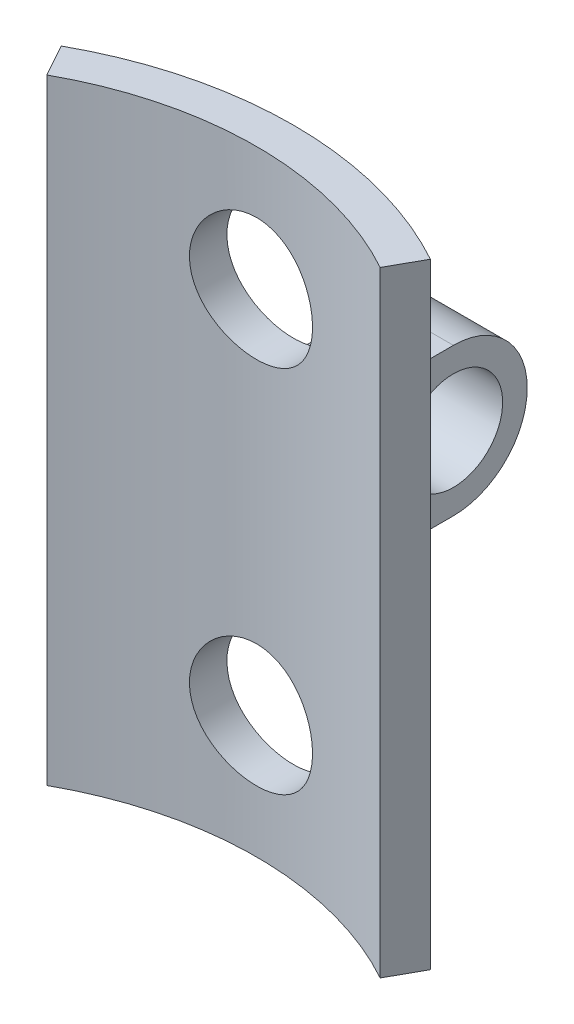
ISO-10303-21;
HEADER;
FILE_DESCRIPTION(('STEP AP214'),'2;1');
FILE_NAME('part.step','',(''),(''),'','','');
FILE_SCHEMA(('AUTOMOTIVE_DESIGN { 1 0 10303 214 1 1 1 1 }'));
ENDSEC;
DATA;
#1=APPLICATION_CONTEXT('core data for automotive mechanical design processes');
#2=APPLICATION_PROTOCOL_DEFINITION('international standard','automotive_design',2000,#1);
#3=PRODUCT_CONTEXT('',#1,'mechanical');
#4=PRODUCT('Part','Part','',(#3));
#5=PRODUCT_RELATED_PRODUCT_CATEGORY('part','',(#4));
#6=PRODUCT_DEFINITION_FORMATION('','',#4);
#7=PRODUCT_DEFINITION_CONTEXT('part definition',#1,'design');
#8=PRODUCT_DEFINITION('design','',#6,#7);
#9=PRODUCT_DEFINITION_SHAPE('','',#8);
#10=(LENGTH_UNIT() NAMED_UNIT(*) SI_UNIT(.MILLI.,.METRE.));
#11=(NAMED_UNIT(*) PLANE_ANGLE_UNIT() SI_UNIT($,.RADIAN.));
#12=(NAMED_UNIT(*) SI_UNIT($,.STERADIAN.) SOLID_ANGLE_UNIT());
#13=UNCERTAINTY_MEASURE_WITH_UNIT(LENGTH_MEASURE(1.E-05),#10,'distance_accuracy_value','');
#14=(GEOMETRIC_REPRESENTATION_CONTEXT(3) GLOBAL_UNCERTAINTY_ASSIGNED_CONTEXT((#13)) GLOBAL_UNIT_ASSIGNED_CONTEXT((#10,
#11,#12)) REPRESENTATION_CONTEXT('',''));
#15=CARTESIAN_POINT('',(0.,0.,0.));
#16=DIRECTION('',(0.,0.,1.));
#17=DIRECTION('',(1.,0.,0.));
#18=AXIS2_PLACEMENT_3D('',#15,#16,#17);
#19=CARTESIAN_POINT('',(0.,25.,0.));
#20=DIRECTION('',(0.,-1.,0.));
#21=DIRECTION('',(0.,0.,-1.));
#22=AXIS2_PLACEMENT_3D('',#19,#20,#21);
#23=CYLINDRICAL_SURFACE('',#22,15.5);
#24=DIRECTION('',(0.,1.,0.));
#25=VECTOR('',#24,1.);
#26=CARTESIAN_POINT('',(-7.49999999999999,0.,-13.5646599662505));
#27=LINE('',#26,#25);
#28=CARTESIAN_POINT('',(-7.49999999999999,0.,-13.5646599662505));
#29=VERTEX_POINT('',#28);
#30=CARTESIAN_POINT('',(-7.49999999999999,25.,-13.5646599662505));
#31=VERTEX_POINT('',#30);
#32=EDGE_CURVE('E217',#29,#31,#27,.T.);
#33=ORIENTED_EDGE('',*,*,#32,.T.);
#34=CARTESIAN_POINT('',(0.,25.,0.));
#35=DIRECTION('',(0.,1.,0.));
#36=DIRECTION('',(0.,0.,1.));
#37=AXIS2_PLACEMENT_3D('',#34,#35,#36);
#38=CIRCLE('',#37,15.5);
#39=CARTESIAN_POINT('',(7.5,25.,-13.5646599662505));
#40=VERTEX_POINT('',#39);
#41=EDGE_CURVE('E418',#40,#31,#38,.T.);
#42=ORIENTED_EDGE('',*,*,#41,.F.);
#43=DIRECTION('',(0.,1.,0.));
#44=VECTOR('',#43,1.);
#45=CARTESIAN_POINT('',(7.5,0.,-13.5646599662505));
#46=LINE('',#45,#44);
#47=CARTESIAN_POINT('',(7.5,0.,-13.5646599662505));
#48=VERTEX_POINT('',#47);
#49=EDGE_CURVE('E408',#48,#40,#46,.T.);
#50=ORIENTED_EDGE('',*,*,#49,.F.);
#51=CARTESIAN_POINT('',(0.,0.,0.));
#52=DIRECTION('',(0.,1.,0.));
#53=DIRECTION('',(0.,0.,1.));
#54=AXIS2_PLACEMENT_3D('',#51,#52,#53);
#55=CIRCLE('',#54,15.5);
#56=EDGE_CURVE('E417',#48,#29,#55,.T.);
#57=ORIENTED_EDGE('',*,*,#56,.T.);
#58=EDGE_LOOP('',(#33,#42,#50,#57));
#59=FACE_BOUND('',#58,.T.);
#60=CARTESIAN_POINT('',(0.,7.5,-15.5));
#61=CARTESIAN_POINT('',(-0.13945596550187,7.49999435258692,-15.4999976564305));
#62=CARTESIAN_POINT('',(-0.278989648774299,7.48829180990405,-15.498098294507));
#63=CARTESIAN_POINT('',(-0.554147970372303,7.44180775903168,-15.4907042283466));
#64=CARTESIAN_POINT('',(-0.689768818906215,7.40700461119143,-15.4852061530574));
#65=CARTESIAN_POINT('',(-0.953080306691496,7.31539380184043,-15.4712317355813));
#66=CARTESIAN_POINT('',(-1.08077717512847,7.25860368561123,-15.4627577686126));
#67=CARTESIAN_POINT('',(-1.32481208801264,7.12467594226584,-15.4437648486657));
#68=CARTESIAN_POINT('',(-1.44115152161203,7.04754080787544,-15.4332461462555));
#69=CARTESIAN_POINT('',(-1.66023096976482,6.87437554390219,-15.4112254446898));
#70=CARTESIAN_POINT('',(-1.76285422580718,6.77819860017883,-15.3997162251001));
#71=CARTESIAN_POINT('',(-1.95058004634512,6.56999582466922,-15.3770673288068));
#72=CARTESIAN_POINT('',(-2.03568153854731,6.45796902361398,-15.3659276747548));
#73=CARTESIAN_POINT('',(-2.18641161674849,6.22045028795695,-15.3452092274256));
#74=CARTESIAN_POINT('',(-2.25192556665198,6.09488472012622,-15.335639765281));
#75=CARTESIAN_POINT('',(-2.36088794560196,5.83435126895828,-15.3192448622395));
#76=CARTESIAN_POINT('',(-2.40433776829785,5.69938398008002,-15.3124192480371));
#77=CARTESIAN_POINT('',(-2.46757236787698,5.42511284801972,-15.3023564578224));
#78=CARTESIAN_POINT('',(-2.48755817575628,5.28585649220208,-15.2990888162356));
#79=CARTESIAN_POINT('',(-2.50392054645118,5.0059313863757,-15.2964196812258));
#80=CARTESIAN_POINT('',(-2.50029867442453,4.86526273061794,-15.2970179314992));
#81=CARTESIAN_POINT('',(-2.46971242247048,4.58793614510759,-15.3019851549817));
#82=CARTESIAN_POINT('',(-2.44297322501096,4.45125263400227,-15.3063177512409));
#83=CARTESIAN_POINT('',(-2.36726444218478,4.18433775550028,-15.3182085898593));
#84=CARTESIAN_POINT('',(-2.31829413868152,4.05410659668619,-15.3257669364201));
#85=CARTESIAN_POINT('',(-2.199282965199,3.80311541366621,-15.3432972328273));
#86=CARTESIAN_POINT('',(-2.1291479638593,3.68240080437212,-15.3532799255619));
#87=CARTESIAN_POINT('',(-1.96986516988218,3.45436827062704,-15.3745265587829));
#88=CARTESIAN_POINT('',(-1.88071593811721,3.34705136118124,-15.3857905962201));
#89=CARTESIAN_POINT('',(-1.6847053407449,3.14755655512885,-15.4084908838004));
#90=CARTESIAN_POINT('',(-1.57765063633714,3.05556856962561,-15.4199276166392));
#91=CARTESIAN_POINT('',(-1.34952355203601,2.89083410566069,-15.441563780858));
#92=CARTESIAN_POINT('',(-1.22845109214106,2.81808773702178,-15.4517632051757));
#93=CARTESIAN_POINT('',(-0.975551393797787,2.69388674499759,-15.4697887128907));
#94=CARTESIAN_POINT('',(-0.8437161289141,2.6424481889378,-15.4776130041165));
#95=CARTESIAN_POINT('',(-0.573123622958436,2.56249549042523,-15.4899920877085));
#96=CARTESIAN_POINT('',(-0.434366924669448,2.5339795533591,-15.4945471360209));
#97=CARTESIAN_POINT('',(-0.155507936088152,2.50093736126125,-15.4998402603816));
#98=CARTESIAN_POINT('',(-0.0154373119722757,2.49615027144566,-15.5006198353955));
#99=CARTESIAN_POINT('',(0.263505183318021,2.51000728697766,-15.4983876056709));
#100=CARTESIAN_POINT('',(0.402377097413027,2.5286505498529,-15.495375937252));
#101=CARTESIAN_POINT('',(0.674179641579104,2.58862212022804,-15.4859252947429));
#102=CARTESIAN_POINT('',(0.807139346222252,2.62982197900365,-15.4795057331587));
#103=CARTESIAN_POINT('',(1.06426429443748,2.73360079053698,-15.463956394067));
#104=CARTESIAN_POINT('',(1.1884290700763,2.79618087979761,-15.4548264724891));
#105=CARTESIAN_POINT('',(1.42557722875196,2.94154597058516,-15.4347667968888));
#106=CARTESIAN_POINT('',(1.53845898550247,3.0244947480993,-15.4238226999924));
#107=CARTESIAN_POINT('',(1.74879333421648,3.20801640827552,-15.4013937987946));
#108=CARTESIAN_POINT('',(1.84624487995349,3.30859048502615,-15.3899089578973));
#109=CARTESIAN_POINT('',(2.02391346599764,3.52567482047743,-15.3675596560275));
#110=CARTESIAN_POINT('',(2.10395472749442,3.64232978374735,-15.3567022684407));
#111=CARTESIAN_POINT('',(2.24330497776141,3.8875825548163,-15.336966998594));
#112=CARTESIAN_POINT('',(2.30261459272167,4.01618000174947,-15.3280890565488));
#113=CARTESIAN_POINT('',(2.3985518735628,4.28116495922091,-15.3133703369419));
#114=CARTESIAN_POINT('',(2.4352687007868,4.4175194970441,-15.3075176352465));
#115=CARTESIAN_POINT('',(2.48525984468867,4.69456224448334,-15.2994815460025));
#116=CARTESIAN_POINT('',(2.49853605803062,4.8352501025376,-15.2972978615812));
#117=CARTESIAN_POINT('',(2.50121879790795,5.11521172968652,-15.2968592838192));
#118=CARTESIAN_POINT('',(2.49090190014529,5.2544828549911,-15.2985588677615));
#119=CARTESIAN_POINT('',(2.44728753575861,5.52928056284299,-15.3055958360373));
#120=CARTESIAN_POINT('',(2.41399013034517,5.66480715536319,-15.3109332106811));
#121=CARTESIAN_POINT('',(2.32546321260479,5.92817182298175,-15.3246275324243));
#122=CARTESIAN_POINT('',(2.27025602486588,6.05601757214045,-15.3329814051373));
#123=CARTESIAN_POINT('',(2.13950475352035,6.30067712120645,-15.3517706698197));
#124=CARTESIAN_POINT('',(2.06395976689479,6.41749043095107,-15.3622061542094));
#125=CARTESIAN_POINT('',(1.8936842922653,6.63816921563136,-15.3841278377586));
#126=CARTESIAN_POINT('',(1.7987498559676,6.74187631323979,-15.3956244279935));
#127=CARTESIAN_POINT('',(1.59282092282896,6.93198373480745,-15.4182887873413));
#128=CARTESIAN_POINT('',(1.48182271718709,7.01838005104163,-15.4294564797998));
#129=CARTESIAN_POINT('',(1.24607150337569,7.17191755140047,-15.4502875855034));
#130=CARTESIAN_POINT('',(1.1212346608815,7.23893138576554,-15.459940867159));
#131=CARTESIAN_POINT('',(0.861974010254038,7.350936088207,-15.4765567288786));
#132=CARTESIAN_POINT('',(0.727560035825843,7.39594918344614,-15.48352202309));
#133=CARTESIAN_POINT('',(0.493830079856465,7.45275644258916,-15.4924336677946));
#134=CARTESIAN_POINT('',(0.395938052856476,7.47044484068466,-15.4952560758332));
#135=CARTESIAN_POINT('',(0.198710490257635,7.49406854032103,-15.4990400624966));
#136=CARTESIAN_POINT('',(0.0993749770888715,7.50000402429215,-15.500001670005));
#137=CARTESIAN_POINT('',(0.,7.5,-15.5));
#138=B_SPLINE_CURVE_WITH_KNOTS('',3,(#60,#61,#62,#63,#64,#65,#66,#67,#68,#69,#70,#71,#72,#73,
#74,#75,#76,#77,#78,#79,#80,#81,#82,#83,#84,#85,#86,#87,#88,#89,#90,#91,#92,#93,#94,#95,#96,#97,
#98,#99,#100,#101,#102,#103,#104,#105,#106,#107,#108,#109,#110,#111,#112,#113,#114,#115,#116,
#117,#118,#119,#120,#121,#122,#123,#124,#125,#126,#127,#128,#129,#130,#131,#132,#133,#134,#135,
#136,#137),.UNSPECIFIED.,.T.,.F.,(4,2,2,2,2,2,2,2,2,2,2,2,2,2,2,2,2,2,2,2,2,2,2,2,2,2,2,2,2,2,2,
2,2,2,2,2,2,2,4),(0.,0.418004691849241,0.836401506137411,1.25446513171859,1.67247755880606,
2.09384807159055,2.51524436366344,2.93906065991642,3.36285018308145,3.78298170620158,
4.20308537544429,4.61914240138764,5.03521286827471,5.45316181311391,5.87114240243266,
6.29396819937044,6.71679640956177,7.13994287886902,7.56305621678383,7.98150808682799,
8.39994491125821,8.81602335960562,9.23212392876015,9.65168652111662,10.0712775492285,
10.4949262103525,10.9185620742536,11.3405151734126,11.7624341292693,12.1794324332903,
12.5964296266045,13.0130030143737,13.4295949014761,13.8508180288141,14.2721385637034,
14.6961675113559,15.11976717602,15.417637914773,15.7155040299017),.UNSPECIFIED.);
#139=CARTESIAN_POINT('',(0.,7.5,-15.5));
#140=VERTEX_POINT('',#139);
#141=EDGE_CURVE('E151',#140,#140,#138,.T.);
#142=ORIENTED_EDGE('',*,*,#141,.T.);
#143=EDGE_LOOP('',(#142));
#144=FACE_BOUND('',#143,.T.);
#145=CARTESIAN_POINT('',(0.,22.5,-15.5));
#146=CARTESIAN_POINT('',(-0.13945596550187,22.4999943525869,-15.4999976564305));
#147=CARTESIAN_POINT('',(-0.278989648774299,22.488291809904,-15.498098294507));
#148=CARTESIAN_POINT('',(-0.554147970372303,22.4418077590317,-15.4907042283466));
#149=CARTESIAN_POINT('',(-0.689768818906215,22.4070046111914,-15.4852061530574));
#150=CARTESIAN_POINT('',(-0.953080306691495,22.3153938018404,-15.4712317355813));
#151=CARTESIAN_POINT('',(-1.08077717512847,22.2586036856112,-15.4627577686126));
#152=CARTESIAN_POINT('',(-1.32481208801264,22.1246759422658,-15.4437648486657));
#153=CARTESIAN_POINT('',(-1.44115152161203,22.0475408078754,-15.4332461462555));
#154=CARTESIAN_POINT('',(-1.66023096976482,21.8743755439022,-15.4112254446898));
#155=CARTESIAN_POINT('',(-1.76285422580718,21.7781986001788,-15.3997162251001));
#156=CARTESIAN_POINT('',(-1.95058004634512,21.5699958246692,-15.3770673288068));
#157=CARTESIAN_POINT('',(-2.03568153854731,21.457969023614,-15.3659276747548));
#158=CARTESIAN_POINT('',(-2.18641161674849,21.2204502879569,-15.3452092274256));
#159=CARTESIAN_POINT('',(-2.25192556665198,21.0948847201262,-15.335639765281));
#160=CARTESIAN_POINT('',(-2.36088794560196,20.8343512689583,-15.3192448622395));
#161=CARTESIAN_POINT('',(-2.40433776829785,20.69938398008,-15.3124192480371));
#162=CARTESIAN_POINT('',(-2.46757236787698,20.4251128480197,-15.3023564578224));
#163=CARTESIAN_POINT('',(-2.48755817575628,20.2858564922021,-15.2990888162356));
#164=CARTESIAN_POINT('',(-2.50392054645118,20.0059313863757,-15.2964196812258));
#165=CARTESIAN_POINT('',(-2.50029867442453,19.8652627306179,-15.2970179314992));
#166=CARTESIAN_POINT('',(-2.46971242247048,19.5879361451076,-15.3019851549817));
#167=CARTESIAN_POINT('',(-2.44297322501096,19.4512526340023,-15.3063177512409));
#168=CARTESIAN_POINT('',(-2.36726444218478,19.1843377555003,-15.3182085898593));
#169=CARTESIAN_POINT('',(-2.31829413868152,19.0541065966862,-15.3257669364201));
#170=CARTESIAN_POINT('',(-2.199282965199,18.8031154136662,-15.3432972328273));
#171=CARTESIAN_POINT('',(-2.1291479638593,18.6824008043721,-15.3532799255619));
#172=CARTESIAN_POINT('',(-1.96986516988218,18.454368270627,-15.3745265587829));
#173=CARTESIAN_POINT('',(-1.88071593811721,18.3470513611812,-15.3857905962201));
#174=CARTESIAN_POINT('',(-1.6847053407449,18.1475565551288,-15.4084908838004));
#175=CARTESIAN_POINT('',(-1.57765063633714,18.0555685696256,-15.4199276166393));
#176=CARTESIAN_POINT('',(-1.34952355203601,17.8908341056607,-15.441563780858));
#177=CARTESIAN_POINT('',(-1.22845109214105,17.8180877370218,-15.4517632051757));
#178=CARTESIAN_POINT('',(-0.975551393797786,17.6938867449976,-15.4697887128907));
#179=CARTESIAN_POINT('',(-0.843716128914099,17.6424481889378,-15.4776130041165));
#180=CARTESIAN_POINT('',(-0.573123622958435,17.5624954904252,-15.4899920877085));
#181=CARTESIAN_POINT('',(-0.434366924669447,17.5339795533591,-15.4945471360209));
#182=CARTESIAN_POINT('',(-0.155507936088151,17.5009373612613,-15.4998402603816));
#183=CARTESIAN_POINT('',(-0.0154373119722739,17.4961502714457,-15.5006198353955));
#184=CARTESIAN_POINT('',(0.263505183318022,17.5100072869777,-15.4983876056709));
#185=CARTESIAN_POINT('',(0.402377097413028,17.5286505498529,-15.495375937252));
#186=CARTESIAN_POINT('',(0.674179641579105,17.588622120228,-15.4859252947429));
#187=CARTESIAN_POINT('',(0.807139346222252,17.6298219790036,-15.4795057331587));
#188=CARTESIAN_POINT('',(1.06426429443748,17.733600790537,-15.463956394067));
#189=CARTESIAN_POINT('',(1.1884290700763,17.7961808797976,-15.4548264724891));
#190=CARTESIAN_POINT('',(1.42557722875196,17.9415459705852,-15.4347667968888));
#191=CARTESIAN_POINT('',(1.53845898550247,18.0244947480993,-15.4238226999924));
#192=CARTESIAN_POINT('',(1.74879333421648,18.2080164082755,-15.4013937987946));
#193=CARTESIAN_POINT('',(1.84624487995349,18.3085904850262,-15.3899089578973));
#194=CARTESIAN_POINT('',(2.02391346599764,18.5256748204774,-15.3675596560275));
#195=CARTESIAN_POINT('',(2.10395472749442,18.6423297837473,-15.3567022684407));
#196=CARTESIAN_POINT('',(2.24330497776141,18.8875825548163,-15.336966998594));
#197=CARTESIAN_POINT('',(2.30261459272167,19.0161800017495,-15.3280890565488));
#198=CARTESIAN_POINT('',(2.3985518735628,19.2811649592209,-15.3133703369419));
#199=CARTESIAN_POINT('',(2.4352687007868,19.4175194970441,-15.3075176352465));
#200=CARTESIAN_POINT('',(2.48525984468867,19.6945622444833,-15.2994815460025));
#201=CARTESIAN_POINT('',(2.49853605803062,19.8352501025376,-15.2972978615812));
#202=CARTESIAN_POINT('',(2.50121879790795,20.1152117296865,-15.2968592838192));
#203=CARTESIAN_POINT('',(2.49090190014529,20.2544828549911,-15.2985588677615));
#204=CARTESIAN_POINT('',(2.44728753575861,20.529280562843,-15.3055958360373));
#205=CARTESIAN_POINT('',(2.41399013034517,20.6648071553632,-15.3109332106811));
#206=CARTESIAN_POINT('',(2.32546321260479,20.9281718229818,-15.3246275324243));
#207=CARTESIAN_POINT('',(2.27025602486588,21.0560175721404,-15.3329814051373));
#208=CARTESIAN_POINT('',(2.13950475352035,21.3006771212064,-15.3517706698197));
#209=CARTESIAN_POINT('',(2.06395976689479,21.4174904309511,-15.3622061542094));
#210=CARTESIAN_POINT('',(1.8936842922653,21.6381692156314,-15.3841278377586));
#211=CARTESIAN_POINT('',(1.79874985596759,21.7418763132398,-15.3956244279935));
#212=CARTESIAN_POINT('',(1.59282092282896,21.9319837348075,-15.4182887873413));
#213=CARTESIAN_POINT('',(1.48182271718709,22.0183800510416,-15.4294564797998));
#214=CARTESIAN_POINT('',(1.24607150337569,22.1719175514005,-15.4502875855034));
#215=CARTESIAN_POINT('',(1.1212346608815,22.2389313857655,-15.459940867159));
#216=CARTESIAN_POINT('',(0.861974010254036,22.350936088207,-15.4765567288786));
#217=CARTESIAN_POINT('',(0.727560035825841,22.3959491834461,-15.48352202309));
#218=CARTESIAN_POINT('',(0.493830079856464,22.4527564425892,-15.4924336677946));
#219=CARTESIAN_POINT('',(0.395938052856475,22.4704448406847,-15.4952560758332));
#220=CARTESIAN_POINT('',(0.198710490257634,22.494068540321,-15.4990400624966));
#221=CARTESIAN_POINT('',(0.0993749770888712,22.5000040242921,-15.500001670005));
#222=CARTESIAN_POINT('',(0.,22.5,-15.5));
#223=B_SPLINE_CURVE_WITH_KNOTS('',3,(#145,#146,#147,#148,#149,#150,#151,#152,#153,#154,#155,
#156,#157,#158,#159,#160,#161,#162,#163,#164,#165,#166,#167,#168,#169,#170,#171,#172,#173,#174,
#175,#176,#177,#178,#179,#180,#181,#182,#183,#184,#185,#186,#187,#188,#189,#190,#191,#192,#193,
#194,#195,#196,#197,#198,#199,#200,#201,#202,#203,#204,#205,#206,#207,#208,#209,#210,#211,#212,
#213,#214,#215,#216,#217,#218,#219,#220,#221,#222),.UNSPECIFIED.,.T.,.F.,(4,2,2,2,2,2,2,2,2,2,2,
2,2,2,2,2,2,2,2,2,2,2,2,2,2,2,2,2,2,2,2,2,2,2,2,2,2,2,4),(0.,0.418004691849242,0.83640150613741,
1.25446513171859,1.67247755880605,2.09384807159054,2.51524436366344,2.93906065991642,
3.36285018308145,3.78298170620157,4.20308537544428,4.61914240138763,5.0352128682747,
5.45316181311391,5.87114240243266,6.29396819937044,6.71679640956176,7.13994287886902,
7.56305621678383,7.98150808682798,8.39994491125821,8.81602335960561,9.23212392876015,
9.65168652111662,10.0712775492285,10.4949262103525,10.9185620742536,11.3405151734125,
11.7624341292693,12.1794324332903,12.5964296266045,13.0130030143737,13.4295949014761,
13.8508180288141,14.2721385637033,14.6961675113559,15.11976717602,15.417637914773,
15.7155040299017),.UNSPECIFIED.);
#224=CARTESIAN_POINT('',(0.,22.5,-15.5));
#225=VERTEX_POINT('',#224);
#226=EDGE_CURVE('E160',#225,#225,#223,.T.);
#227=ORIENTED_EDGE('',*,*,#226,.T.);
#228=EDGE_LOOP('',(#227));
#229=FACE_BOUND('',#228,.T.);
#230=CARTESIAN_POINT('',(0.,9.5,0.));
#231=DIRECTION('',(0.,-1.,0.));
#232=DIRECTION('',(0.,0.,-1.));
#233=AXIS2_PLACEMENT_3D('',#230,#231,#232);
#234=CIRCLE('',#233,15.5);
#235=CARTESIAN_POINT('',(-2.34848484848485,9.5,-15.3210514951304));
#236=VERTEX_POINT('',#235);
#237=CARTESIAN_POINT('',(2.34848484848485,9.5,-15.3210514951304));
#238=VERTEX_POINT('',#237);
#239=EDGE_CURVE('E226',#236,#238,#234,.T.);
#240=ORIENTED_EDGE('',*,*,#239,.T.);
#241=DIRECTION('',(0.,-1.,0.));
#242=VECTOR('',#241,1.);
#243=CARTESIAN_POINT('',(2.34848484848485,25.,-15.3210514951304));
#244=LINE('',#243,#242);
#245=CARTESIAN_POINT('',(2.34848484848485,15.5,-15.3210514951304));
#246=VERTEX_POINT('',#245);
#247=EDGE_CURVE('E229',#238,#246,#244,.F.);
#248=ORIENTED_EDGE('',*,*,#247,.T.);
#249=CARTESIAN_POINT('',(0.,15.5,0.));
#250=DIRECTION('',(0.,1.,0.));
#251=DIRECTION('',(0.,0.,1.));
#252=AXIS2_PLACEMENT_3D('',#249,#250,#251);
#253=CIRCLE('',#252,15.5);
#254=CARTESIAN_POINT('',(-2.34848484848485,15.5,-15.3210514951304));
#255=VERTEX_POINT('',#254);
#256=EDGE_CURVE('E233',#246,#255,#253,.T.);
#257=ORIENTED_EDGE('',*,*,#256,.T.);
#258=DIRECTION('',(0.,-1.,0.));
#259=VECTOR('',#258,1.);
#260=CARTESIAN_POINT('',(-2.34848484848485,25.,-15.3210514951304));
#261=LINE('',#260,#259);
#262=EDGE_CURVE('E232',#255,#236,#261,.T.);
#263=ORIENTED_EDGE('',*,*,#262,.T.);
#264=EDGE_LOOP('',(#240,#248,#257,#263));
#265=FACE_BOUND('',#264,.T.);
#266=ADVANCED_FACE('F41',(#59,#144,#229,#265),#23,.T.);
#267=CARTESIAN_POINT('',(0.,25.,0.));
#268=DIRECTION('',(0.,1.,0.));
#269=DIRECTION('',(0.,0.,1.));
#270=AXIS2_PLACEMENT_3D('',#267,#268,#269);
#271=PLANE('',#270);
#272=ORIENTED_EDGE('',*,*,#41,.T.);
#273=DIRECTION('',(0.483870967741935,0.,0.875139352661325));
#274=VECTOR('',#273,1.);
#275=CARTESIAN_POINT('',(0.,25.,0.));
#276=LINE('',#275,#274);
#277=CARTESIAN_POINT('',(-6.7741935483871,25.,-12.2519509372585));
#278=VERTEX_POINT('',#277);
#279=EDGE_CURVE('E435',#31,#278,#276,.T.);
#280=ORIENTED_EDGE('',*,*,#279,.T.);
#281=CARTESIAN_POINT('',(0.,25.,0.));
#282=DIRECTION('',(0.,1.,0.));
#283=DIRECTION('',(0.,0.,1.));
#284=AXIS2_PLACEMENT_3D('',#281,#282,#283);
#285=CIRCLE('',#284,14.);
#286=CARTESIAN_POINT('',(6.7741935483871,25.,-12.2519509372585));
#287=VERTEX_POINT('',#286);
#288=EDGE_CURVE('E420',#287,#278,#285,.T.);
#289=ORIENTED_EDGE('',*,*,#288,.F.);
#290=DIRECTION('',(0.483870967741935,0.,-0.875139352661325));
#291=VECTOR('',#290,1.);
#292=CARTESIAN_POINT('',(0.,25.,0.));
#293=LINE('',#292,#291);
#294=EDGE_CURVE('E433',#287,#40,#293,.T.);
#295=ORIENTED_EDGE('',*,*,#294,.T.);
#296=EDGE_LOOP('',(#272,#280,#289,#295));
#297=FACE_BOUND('',#296,.T.);
#298=ADVANCED_FACE('F200',(#297),#271,.T.);
#299=CARTESIAN_POINT('',(0.,0.,0.));
#300=DIRECTION('',(0.,1.,0.));
#301=DIRECTION('',(0.,0.,1.));
#302=AXIS2_PLACEMENT_3D('',#299,#300,#301);
#303=PLANE('',#302);
#304=DIRECTION('',(0.483870967741935,0.,0.875139352661325));
#305=VECTOR('',#304,1.);
#306=CARTESIAN_POINT('',(0.,0.,0.));
#307=LINE('',#306,#305);
#308=CARTESIAN_POINT('',(-6.7741935483871,0.,-12.2519509372585));
#309=VERTEX_POINT('',#308);
#310=EDGE_CURVE('E415',#29,#309,#307,.T.);
#311=ORIENTED_EDGE('',*,*,#310,.F.);
#312=ORIENTED_EDGE('',*,*,#56,.F.);
#313=DIRECTION('',(0.483870967741935,0.,-0.875139352661325));
#314=VECTOR('',#313,1.);
#315=CARTESIAN_POINT('',(0.,0.,0.));
#316=LINE('',#315,#314);
#317=CARTESIAN_POINT('',(6.7741935483871,0.,-12.2519509372586));
#318=VERTEX_POINT('',#317);
#319=EDGE_CURVE('E406',#318,#48,#316,.T.);
#320=ORIENTED_EDGE('',*,*,#319,.F.);
#321=CARTESIAN_POINT('',(0.,0.,0.));
#322=DIRECTION('',(0.,1.,0.));
#323=DIRECTION('',(0.,0.,1.));
#324=AXIS2_PLACEMENT_3D('',#321,#322,#323);
#325=CIRCLE('',#324,14.);
#326=EDGE_CURVE('E424',#318,#309,#325,.T.);
#327=ORIENTED_EDGE('',*,*,#326,.T.);
#328=EDGE_LOOP('',(#311,#312,#320,#327));
#329=FACE_BOUND('',#328,.T.);
#330=ADVANCED_FACE('F198',(#329),#303,.F.);
#331=CARTESIAN_POINT('',(0.,25.,0.));
#332=DIRECTION('',(0.,-1.,0.));
#333=DIRECTION('',(0.,0.,-1.));
#334=AXIS2_PLACEMENT_3D('',#331,#332,#333);
#335=CYLINDRICAL_SURFACE('',#334,14.);
#336=CARTESIAN_POINT('',(0.,22.5,-14.));
#337=CARTESIAN_POINT('',(-0.139239584884692,22.4999945573978,-13.9999975279519));
#338=CARTESIAN_POINT('',(-0.278551398798768,22.4883280975496,-13.9979012185717));
#339=CARTESIAN_POINT('',(-0.55325746155145,22.4419958336177,-13.9897405917584));
#340=CARTESIAN_POINT('',(-0.688648164109867,22.4073098491621,-13.9836727927304));
#341=CARTESIAN_POINT('',(-0.951498716003345,22.316027766762,-13.9682487550673));
#342=CARTESIAN_POINT('',(-1.07896532023462,22.2594506356316,-13.9588953637627));
#343=CARTESIAN_POINT('',(-1.32258294398845,22.1260443117829,-13.9379246329878));
#344=CARTESIAN_POINT('',(-1.43873504418376,22.0492170558005,-13.9263075100501));
#345=CARTESIAN_POINT('',(-1.65770744324836,21.8766007869825,-13.9019523246795));
#346=CARTESIAN_POINT('',(-1.76038642030698,21.7806338701291,-13.8892044205267));
#347=CARTESIAN_POINT('',(-1.94827611327337,21.5728452504625,-13.8640984861177));
#348=CARTESIAN_POINT('',(-2.03348564380397,21.4610224726311,-13.851740482366));
#349=CARTESIAN_POINT('',(-2.18459604528548,21.2237098828865,-13.828718102426));
#350=CARTESIAN_POINT('',(-2.25035491937039,21.098128313076,-13.8180664295287));
#351=CARTESIAN_POINT('',(-2.35978878168924,20.8374788413355,-13.799800524336));
#352=CARTESIAN_POINT('',(-2.40346549014524,20.7024116792762,-13.7921860554493));
#353=CARTESIAN_POINT('',(-2.46704527057167,20.4281311785851,-13.7809553111512));
#354=CARTESIAN_POINT('',(-2.48719373563911,20.2889764448584,-13.7772977959189));
#355=CARTESIAN_POINT('',(-2.50390640595674,20.0092170779927,-13.7742705702387));
#356=CARTESIAN_POINT('',(-2.50047252779549,19.8686125636079,-13.7749005113397));
#357=CARTESIAN_POINT('',(-2.47031736473549,19.5917111025635,-13.78033942777));
#358=CARTESIAN_POINT('',(-2.44387361595034,19.4553828097458,-13.7850985960022));
#359=CARTESIAN_POINT('',(-2.3688857538611,19.1891293635014,-13.7981816164894));
#360=CARTESIAN_POINT('',(-2.3203407810603,19.0592044593146,-13.8065056073765));
#361=CARTESIAN_POINT('',(-2.2022526779638,18.8086255211308,-13.8258332062344));
#362=CARTESIAN_POINT('',(-2.13259607876041,18.6880261183911,-13.836851230427));
#363=CARTESIAN_POINT('',(-1.97434240206301,18.4601224977845,-13.8603157063341));
#364=CARTESIAN_POINT('',(-1.88574357580469,18.3528195089008,-13.8727622898853));
#365=CARTESIAN_POINT('',(-1.69061708906587,18.1529497822127,-13.8978993100277));
#366=CARTESIAN_POINT('',(-1.58385171151662,18.0606150820204,-13.9105906924877));
#367=CARTESIAN_POINT('',(-1.35622200140277,17.895133867092,-13.934623736005));
#368=CARTESIAN_POINT('',(-1.23535755129116,17.8219875123497,-13.9459653858077));
#369=CARTESIAN_POINT('',(-0.982729125410291,17.6969309763037,-13.9660408385903));
#370=CARTESIAN_POINT('',(-0.850953766692503,17.6450433177021,-13.9747718731006));
#371=CARTESIAN_POINT('',(-0.58036740103594,17.564203117808,-13.9886206199705));
#372=CARTESIAN_POINT('',(-0.441557072364819,17.5352483699271,-13.9937386799627));
#373=CARTESIAN_POINT('',(-0.16283898538171,17.501415153955,-13.999737506353));
#374=CARTESIAN_POINT('',(-0.0229710170574315,17.496218491452,-14.0006742692249));
#375=CARTESIAN_POINT('',(0.255635962261019,17.5091977397633,-13.9983590537919));
#376=CARTESIAN_POINT('',(0.394375023096461,17.5273726130279,-13.9951072614327));
#377=CARTESIAN_POINT('',(0.66578830988004,17.5863143984903,-13.9848150834562));
#378=CARTESIAN_POINT('',(0.798498270193175,17.6269218392178,-13.9778014506051));
#379=CARTESIAN_POINT('',(1.0552266666947,17.7294046301854,-13.960768732277));
#380=CARTESIAN_POINT('',(1.17924455600831,17.7912813171688,-13.9507494579045));
#381=CARTESIAN_POINT('',(1.4164370995142,17.9352612229124,-13.9286773386827));
#382=CARTESIAN_POINT('',(1.52949072853056,18.0175607915398,-13.9166051337771));
#383=CARTESIAN_POINT('',(1.74029662989026,18.1997826510615,-13.8918196803142));
#384=CARTESIAN_POINT('',(1.8380476135904,18.2997064245934,-13.8791063778887));
#385=CARTESIAN_POINT('',(2.01666949257316,18.5157749692476,-13.8542878912599));
#386=CARTESIAN_POINT('',(2.09732417121668,18.6320997008671,-13.8421918152179));
#387=CARTESIAN_POINT('',(2.23794827077399,18.8768336894488,-13.8201546664427));
#388=CARTESIAN_POINT('',(2.29791841370413,19.0052425244028,-13.8102135184939));
#389=CARTESIAN_POINT('',(2.39515706197428,19.2699261748407,-13.7936819036385));
#390=CARTESIAN_POINT('',(2.43252842924635,19.4061622108181,-13.7870762776017));
#391=CARTESIAN_POINT('',(2.48382895891452,19.6831072951463,-13.7779274424092));
#392=CARTESIAN_POINT('',(2.49776049425864,19.8238158892447,-13.7753838220348));
#393=CARTESIAN_POINT('',(2.50171229780526,20.1035492089015,-13.7746664843416));
#394=CARTESIAN_POINT('',(2.49207328035334,20.2425690771419,-13.7764304992774));
#395=CARTESIAN_POINT('',(2.44989946243099,20.5169738180181,-13.7839923104721));
#396=CARTESIAN_POINT('',(2.4173647696137,20.6523587077421,-13.7897900877646));
#397=CARTESIAN_POINT('',(2.3304611386535,20.9154898760334,-13.8047410588042));
#398=CARTESIAN_POINT('',(2.27612576514715,21.0432475517861,-13.8138890925692));
#399=CARTESIAN_POINT('',(2.14719934056736,21.2878884394367,-13.8345140264404));
#400=CARTESIAN_POINT('',(2.07260704454505,21.4047709823784,-13.8459910696717));
#401=CARTESIAN_POINT('',(1.90408567428783,21.62605704739,-13.8701759776461));
#402=CARTESIAN_POINT('',(1.80990741155503,21.7302692317432,-13.882898459028));
#403=CARTESIAN_POINT('',(1.60540999726032,21.9215258059662,-13.9080282435319));
#404=CARTESIAN_POINT('',(1.49508713803928,22.0085662414773,-13.920435473485));
#405=CARTESIAN_POINT('',(1.26037074660264,22.1636577677888,-13.9436534678806));
#406=CARTESIAN_POINT('',(1.13587103767058,22.2315502593916,-13.9544505684285));
#407=CARTESIAN_POINT('',(0.877084840190479,22.3453492032927,-13.9730987112511));
#408=CARTESIAN_POINT('',(0.742807935956542,22.3912768614976,-13.9809525934581));
#409=CARTESIAN_POINT('',(0.506731755491748,22.4502306133961,-13.9911779735748));
#410=CARTESIAN_POINT('',(0.40633486767167,22.4688631369367,-13.9944679971863));
#411=CARTESIAN_POINT('',(0.20397155203894,22.4937496904037,-13.9988798925243));
#412=CARTESIAN_POINT('',(0.102005158109662,22.5000039871815,-14.0000018109911));
#413=CARTESIAN_POINT('',(0.,22.5,-14.));
#414=B_SPLINE_CURVE_WITH_KNOTS('',3,(#336,#337,#338,#339,#340,#341,#342,#343,#344,#345,#346,
#347,#348,#349,#350,#351,#352,#353,#354,#355,#356,#357,#358,#359,#360,#361,#362,#363,#364,#365,
#366,#367,#368,#369,#370,#371,#372,#373,#374,#375,#376,#377,#378,#379,#380,#381,#382,#383,#384,
#385,#386,#387,#388,#389,#390,#391,#392,#393,#394,#395,#396,#397,#398,#399,#400,#401,#402,#403,
#404,#405,#406,#407,#408,#409,#410,#411,#412,#413),.UNSPECIFIED.,.T.,.F.,(4,2,2,2,2,2,2,2,2,2,2,
2,2,2,2,2,2,2,2,2,2,2,2,2,2,2,2,2,2,2,2,2,2,2,2,2,2,2,4),(0.,0.41734579674163,0.835057949374025,
1.25240899749004,1.66972014433903,2.09110796789026,2.51252437496281,2.93694536469338,
3.36133328652202,3.78125426758825,4.20114112116256,4.61603258426602,5.03094018350354,
5.44811857395103,5.86533549534551,6.28850377891475,6.71167559078141,7.13529458336167,
7.55887281066884,7.97676106621614,8.3946307707832,8.80956740145243,9.2245301150951,
9.6436484048813,10.062801969859,10.4869762077788,10.9111356379343,11.3333496148672,
11.7555208460958,12.1716257235315,12.5877286444974,13.0031933708605,13.4186836366131,
13.8398246877353,14.2610626074925,14.6856934454013,15.109913492521,15.4156623340469,
15.7214045841282),.UNSPECIFIED.);
#415=CARTESIAN_POINT('',(0.,22.5,-14.));
#416=VERTEX_POINT('',#415);
#417=EDGE_CURVE('E159',#416,#416,#414,.T.);
#418=ORIENTED_EDGE('',*,*,#417,.F.);
#419=EDGE_LOOP('',(#418));
#420=FACE_BOUND('',#419,.T.);
#421=CARTESIAN_POINT('',(0.,7.5,-14.));
#422=CARTESIAN_POINT('',(-0.139239584884692,7.49999455739785,-13.9999975279519));
#423=CARTESIAN_POINT('',(-0.278551398798768,7.48832809754965,-13.9979012185717));
#424=CARTESIAN_POINT('',(-0.55325746155145,7.44199583361771,-13.9897405917584));
#425=CARTESIAN_POINT('',(-0.688648164109867,7.40730984916214,-13.9836727927304));
#426=CARTESIAN_POINT('',(-0.951498716003345,7.31602776676197,-13.9682487550673));
#427=CARTESIAN_POINT('',(-1.07896532023462,7.2594506356316,-13.9588953637627));
#428=CARTESIAN_POINT('',(-1.32258294398845,7.12604431178294,-13.9379246329878));
#429=CARTESIAN_POINT('',(-1.43873504418376,7.04921705580053,-13.9263075100501));
#430=CARTESIAN_POINT('',(-1.65770744324836,6.87660078698247,-13.9019523246795));
#431=CARTESIAN_POINT('',(-1.76038642030698,6.7806338701291,-13.8892044205267));
#432=CARTESIAN_POINT('',(-1.94827611327337,6.57284525046249,-13.8640984861177));
#433=CARTESIAN_POINT('',(-2.03348564380397,6.46102247263114,-13.851740482366));
#434=CARTESIAN_POINT('',(-2.18459604528548,6.22370988288653,-13.828718102426));
#435=CARTESIAN_POINT('',(-2.25035491937039,6.09812831307603,-13.8180664295287));
#436=CARTESIAN_POINT('',(-2.35978878168925,5.8374788413355,-13.799800524336));
#437=CARTESIAN_POINT('',(-2.40346549014524,5.70241167927617,-13.7921860554493));
#438=CARTESIAN_POINT('',(-2.46704527057167,5.42813117858515,-13.7809553111512));
#439=CARTESIAN_POINT('',(-2.48719373563912,5.2889764448584,-13.7772977959189));
#440=CARTESIAN_POINT('',(-2.50390640595674,5.00921707799267,-13.7742705702387));
#441=CARTESIAN_POINT('',(-2.5004725277955,4.86861256360791,-13.7749005113397));
#442=CARTESIAN_POINT('',(-2.47031736473549,4.59171110256346,-13.78033942777));
#443=CARTESIAN_POINT('',(-2.44387361595034,4.45538280974577,-13.7850985960022));
#444=CARTESIAN_POINT('',(-2.3688857538611,4.18912936350145,-13.7981816164894));
#445=CARTESIAN_POINT('',(-2.3203407810603,4.05920445931462,-13.8065056073765));
#446=CARTESIAN_POINT('',(-2.2022526779638,3.80862552113076,-13.8258332062344));
#447=CARTESIAN_POINT('',(-2.13259607876041,3.68802611839112,-13.836851230427));
#448=CARTESIAN_POINT('',(-1.97434240206301,3.46012249778453,-13.8603157063341));
#449=CARTESIAN_POINT('',(-1.88574357580469,3.35281950890081,-13.8727622898853));
#450=CARTESIAN_POINT('',(-1.69061708906587,3.15294978221267,-13.8978993100277));
#451=CARTESIAN_POINT('',(-1.58385171151662,3.06061508202043,-13.9105906924877));
#452=CARTESIAN_POINT('',(-1.35622200140277,2.89513386709199,-13.934623736005));
#453=CARTESIAN_POINT('',(-1.23535755129116,2.82198751234968,-13.9459653858077));
#454=CARTESIAN_POINT('',(-0.982729125410291,2.69693097630372,-13.9660408385903));
#455=CARTESIAN_POINT('',(-0.850953766692503,2.6450433177021,-13.9747718731006));
#456=CARTESIAN_POINT('',(-0.580367401035941,2.56420311780802,-13.9886206199705));
#457=CARTESIAN_POINT('',(-0.44155707236482,2.53524836992713,-13.9937386799627));
#458=CARTESIAN_POINT('',(-0.162838985381712,2.50141515395496,-13.999737506353));
#459=CARTESIAN_POINT('',(-0.0229710170574329,2.49621849145196,-14.0006742692249));
#460=CARTESIAN_POINT('',(0.255635962261018,2.50919773976331,-13.9983590537919));
#461=CARTESIAN_POINT('',(0.39437502309646,2.52737261302788,-13.9951072614327));
#462=CARTESIAN_POINT('',(0.665788309880039,2.5863143984903,-13.9848150834562));
#463=CARTESIAN_POINT('',(0.798498270193175,2.62692183921779,-13.9778014506051));
#464=CARTESIAN_POINT('',(1.0552266666947,2.72940463018542,-13.960768732277));
#465=CARTESIAN_POINT('',(1.17924455600831,2.7912813171688,-13.9507494579045));
#466=CARTESIAN_POINT('',(1.4164370995142,2.93526122291235,-13.9286773386827));
#467=CARTESIAN_POINT('',(1.52949072853056,3.0175607915398,-13.9166051337771));
#468=CARTESIAN_POINT('',(1.74029662989026,3.19978265106152,-13.8918196803142));
#469=CARTESIAN_POINT('',(1.8380476135904,3.29970642459343,-13.8791063778887));
#470=CARTESIAN_POINT('',(2.01666949257316,3.51577496924755,-13.8542878912599));
#471=CARTESIAN_POINT('',(2.09732417121668,3.63209970086714,-13.8421918152179));
#472=CARTESIAN_POINT('',(2.23794827077399,3.87683368944879,-13.8201546664427));
#473=CARTESIAN_POINT('',(2.29791841370413,4.00524252440282,-13.8102135184939));
#474=CARTESIAN_POINT('',(2.39515706197428,4.26992617484068,-13.7936819036385));
#475=CARTESIAN_POINT('',(2.43252842924636,4.40616221081811,-13.7870762776017));
#476=CARTESIAN_POINT('',(2.48382895891452,4.68310729514624,-13.7779274424092));
#477=CARTESIAN_POINT('',(2.49776049425864,4.82381588924471,-13.7753838220348));
#478=CARTESIAN_POINT('',(2.50171229780526,5.10354920890146,-13.7746664843416));
#479=CARTESIAN_POINT('',(2.49207328035334,5.24256907714185,-13.7764304992774));
#480=CARTESIAN_POINT('',(2.44989946243099,5.51697381801807,-13.7839923104721));
#481=CARTESIAN_POINT('',(2.41736476961371,5.65235870774211,-13.7897900877646));
#482=CARTESIAN_POINT('',(2.3304611386535,5.91548987603338,-13.8047410588042));
#483=CARTESIAN_POINT('',(2.27612576514716,6.0432475517861,-13.8138890925692));
#484=CARTESIAN_POINT('',(2.14719934056736,6.28788843943675,-13.8345140264404));
#485=CARTESIAN_POINT('',(2.07260704454505,6.40477098237841,-13.8459910696717));
#486=CARTESIAN_POINT('',(1.90408567428783,6.62605704739003,-13.8701759776461));
#487=CARTESIAN_POINT('',(1.80990741155503,6.73026923174324,-13.882898459028));
#488=CARTESIAN_POINT('',(1.60540999726032,6.92152580596623,-13.9080282435319));
#489=CARTESIAN_POINT('',(1.49508713803928,7.00856624147728,-13.920435473485));
#490=CARTESIAN_POINT('',(1.26037074660264,7.16365776778883,-13.9436534678806));
#491=CARTESIAN_POINT('',(1.13587103767058,7.23155025939159,-13.9544505684285));
#492=CARTESIAN_POINT('',(0.877084840190481,7.34534920329274,-13.9730987112511));
#493=CARTESIAN_POINT('',(0.742807935956545,7.39127686149759,-13.9809525934581));
#494=CARTESIAN_POINT('',(0.506731755491751,7.45023061339609,-13.9911779735748));
#495=CARTESIAN_POINT('',(0.406334867671672,7.46886313693672,-13.9944679971863));
#496=CARTESIAN_POINT('',(0.203971552038941,7.49374969040371,-13.9988798925243));
#497=CARTESIAN_POINT('',(0.102005158109662,7.50000398718148,-14.0000018109911));
#498=CARTESIAN_POINT('',(0.,7.5,-14.));
#499=B_SPLINE_CURVE_WITH_KNOTS('',3,(#421,#422,#423,#424,#425,#426,#427,#428,#429,#430,#431,
#432,#433,#434,#435,#436,#437,#438,#439,#440,#441,#442,#443,#444,#445,#446,#447,#448,#449,#450,
#451,#452,#453,#454,#455,#456,#457,#458,#459,#460,#461,#462,#463,#464,#465,#466,#467,#468,#469,
#470,#471,#472,#473,#474,#475,#476,#477,#478,#479,#480,#481,#482,#483,#484,#485,#486,#487,#488,
#489,#490,#491,#492,#493,#494,#495,#496,#497,#498),.UNSPECIFIED.,.T.,.F.,(4,2,2,2,2,2,2,2,2,2,2,
2,2,2,2,2,2,2,2,2,2,2,2,2,2,2,2,2,2,2,2,2,2,2,2,2,2,2,4),(0.,0.417345796741631,
0.835057949374026,1.25240899749004,1.66972014433903,2.09110796789027,2.51252437496281,
2.93694536469338,3.36133328652202,3.78125426758825,4.20114112116257,4.61603258426602,
5.03094018350355,5.44811857395104,5.86533549534551,6.28850377891475,6.71167559078142,
7.13529458336167,7.55887281066884,7.97676106621614,8.39463077078321,8.80956740145243,
9.22453011509511,9.64364840488131,10.062801969859,10.4869762077788,10.9111356379343,
11.3333496148672,11.7555208460958,12.1716257235315,12.5877286444974,13.0031933708605,
13.4186836366131,13.8398246877353,14.2610626074926,14.6856934454013,15.109913492521,
15.4156623340469,15.7214045841282),.UNSPECIFIED.);
#500=CARTESIAN_POINT('',(0.,7.5,-14.));
#501=VERTEX_POINT('',#500);
#502=EDGE_CURVE('E149',#501,#501,#499,.T.);
#503=ORIENTED_EDGE('',*,*,#502,.F.);
#504=EDGE_LOOP('',(#503));
#505=FACE_BOUND('',#504,.T.);
#506=ORIENTED_EDGE('',*,*,#288,.T.);
#507=DIRECTION('',(0.,-1.,0.));
#508=VECTOR('',#507,1.);
#509=CARTESIAN_POINT('',(-6.7741935483871,25.,-12.2519509372585));
#510=LINE('',#509,#508);
#511=EDGE_CURVE('E188',#278,#309,#510,.T.);
#512=ORIENTED_EDGE('',*,*,#511,.T.);
#513=ORIENTED_EDGE('',*,*,#326,.F.);
#514=DIRECTION('',(0.,-1.,0.));
#515=VECTOR('',#514,1.);
#516=CARTESIAN_POINT('',(6.7741935483871,25.,-12.2519509372586));
#517=LINE('',#516,#515);
#518=EDGE_CURVE('E411',#318,#287,#517,.F.);
#519=ORIENTED_EDGE('',*,*,#518,.T.);
#520=EDGE_LOOP('',(#506,#512,#513,#519));
#521=FACE_BOUND('',#520,.T.);
#522=ADVANCED_FACE('F194',(#420,#505,#521),#335,.F.);
#523=CARTESIAN_POINT('',(0.,0.,0.));
#524=DIRECTION('',(0.875139352661325,0.,0.483870967741935));
#525=DIRECTION('',(0.483870967741935,0.,-0.875139352661325));
#526=AXIS2_PLACEMENT_3D('',#523,#524,#525);
#527=PLANE('',#526);
#528=ORIENTED_EDGE('',*,*,#319,.T.);
#529=ORIENTED_EDGE('',*,*,#49,.T.);
#530=ORIENTED_EDGE('',*,*,#294,.F.);
#531=ORIENTED_EDGE('',*,*,#518,.F.);
#532=EDGE_LOOP('',(#528,#529,#530,#531));
#533=FACE_BOUND('',#532,.T.);
#534=ADVANCED_FACE('F177',(#533),#527,.T.);
#535=CARTESIAN_POINT('',(0.,0.,0.));
#536=DIRECTION('',(-0.875139352661325,0.,0.483870967741935));
#537=DIRECTION('',(0.483870967741935,0.,0.875139352661325));
#538=AXIS2_PLACEMENT_3D('',#535,#536,#537);
#539=PLANE('',#538);
#540=ORIENTED_EDGE('',*,*,#279,.F.);
#541=ORIENTED_EDGE('',*,*,#32,.F.);
#542=ORIENTED_EDGE('',*,*,#310,.T.);
#543=ORIENTED_EDGE('',*,*,#511,.F.);
#544=EDGE_LOOP('',(#540,#541,#542,#543));
#545=FACE_BOUND('',#544,.T.);
#546=ADVANCED_FACE('F173',(#545),#539,.T.);
#547=CARTESIAN_POINT('',(0.,5.,-15.5));
#548=DIRECTION('',(0.,0.,1.));
#549=DIRECTION('',(1.,0.,0.));
#550=AXIS2_PLACEMENT_3D('',#547,#548,#549);
#551=CYLINDRICAL_SURFACE('',#550,2.5);
#552=ORIENTED_EDGE('',*,*,#502,.T.);
#553=EDGE_LOOP('',(#552));
#554=FACE_BOUND('',#553,.T.);
#555=ORIENTED_EDGE('',*,*,#141,.F.);
#556=EDGE_LOOP('',(#555));
#557=FACE_BOUND('',#556,.T.);
#558=ADVANCED_FACE('F168',(#554,#557),#551,.F.);
#559=CARTESIAN_POINT('',(0.,20.,-15.5));
#560=DIRECTION('',(0.,0.,1.));
#561=DIRECTION('',(1.,0.,0.));
#562=AXIS2_PLACEMENT_3D('',#559,#560,#561);
#563=CYLINDRICAL_SURFACE('',#562,2.5);
#564=ORIENTED_EDGE('',*,*,#417,.T.);
#565=EDGE_LOOP('',(#564));
#566=FACE_BOUND('',#565,.T.);
#567=ORIENTED_EDGE('',*,*,#226,.F.);
#568=EDGE_LOOP('',(#567));
#569=FACE_BOUND('',#568,.T.);
#570=ADVANCED_FACE('F172',(#566,#569),#563,.F.);
#571=CARTESIAN_POINT('',(1.5,12.5,-20.5));
#572=DIRECTION('',(-1.,0.,0.));
#573=DIRECTION('',(0.,0.,1.));
#574=AXIS2_PLACEMENT_3D('',#571,#572,#573);
#575=PLANE('',#574);
#576=CARTESIAN_POINT('',(1.5,12.5,-20.5));
#577=DIRECTION('',(-1.,0.,0.));
#578=DIRECTION('',(0.,0.,1.));
#579=AXIS2_PLACEMENT_3D('',#576,#577,#578);
#580=CIRCLE('',#579,2.);
#581=CARTESIAN_POINT('',(1.5,12.5,-18.5));
#582=VERTEX_POINT('',#581);
#583=EDGE_CURVE('E142',#582,#582,#580,.T.);
#584=ORIENTED_EDGE('',*,*,#583,.T.);
#585=EDGE_LOOP('',(#584));
#586=FACE_BOUND('',#585,.T.);
#587=DIRECTION('',(0.,0.,-1.));
#588=VECTOR('',#587,1.);
#589=CARTESIAN_POINT('',(1.5,15.5,-20.5));
#590=LINE('',#589,#588);
#591=CARTESIAN_POINT('',(1.5,15.5,-16.3095064303001));
#592=VERTEX_POINT('',#591);
#593=CARTESIAN_POINT('',(1.5,15.5,-20.5));
#594=VERTEX_POINT('',#593);
#595=EDGE_CURVE('E128',#592,#594,#590,.T.);
#596=ORIENTED_EDGE('',*,*,#595,.F.);
#597=DIRECTION('',(0.,1.,0.));
#598=VECTOR('',#597,1.);
#599=CARTESIAN_POINT('',(1.5,9.5,-16.3095064303001));
#600=LINE('',#599,#598);
#601=CARTESIAN_POINT('',(1.5,9.5,-16.3095064303001));
#602=VERTEX_POINT('',#601);
#603=EDGE_CURVE('E243',#592,#602,#600,.F.);
#604=ORIENTED_EDGE('',*,*,#603,.T.);
#605=DIRECTION('',(0.,0.,1.));
#606=VECTOR('',#605,1.);
#607=CARTESIAN_POINT('',(1.5,9.5,-20.5));
#608=LINE('',#607,#606);
#609=CARTESIAN_POINT('',(1.5,9.5,-20.5));
#610=VERTEX_POINT('',#609);
#611=EDGE_CURVE('E146',#610,#602,#608,.T.);
#612=ORIENTED_EDGE('',*,*,#611,.F.);
#613=CARTESIAN_POINT('',(1.5,12.5,-20.5));
#614=DIRECTION('',(-1.,0.,0.));
#615=DIRECTION('',(0.,0.,1.));
#616=AXIS2_PLACEMENT_3D('',#613,#614,#615);
#617=CIRCLE('',#616,3.);
#618=EDGE_CURVE('E124',#594,#610,#617,.T.);
#619=ORIENTED_EDGE('',*,*,#618,.F.);
#620=EDGE_LOOP('',(#596,#604,#612,#619));
#621=FACE_BOUND('',#620,.T.);
#622=ADVANCED_FACE('F251',(#586,#621),#575,.F.);
#623=CARTESIAN_POINT('',(-1.5,12.5,-20.5));
#624=DIRECTION('',(-1.,0.,0.));
#625=DIRECTION('',(0.,0.,1.));
#626=AXIS2_PLACEMENT_3D('',#623,#624,#625);
#627=PLANE('',#626);
#628=CARTESIAN_POINT('',(-1.5,12.5,-20.5));
#629=DIRECTION('',(-1.,0.,0.));
#630=DIRECTION('',(0.,0.,1.));
#631=AXIS2_PLACEMENT_3D('',#628,#629,#630);
#632=CIRCLE('',#631,2.);
#633=CARTESIAN_POINT('',(-1.5,12.5,-18.5));
#634=VERTEX_POINT('',#633);
#635=EDGE_CURVE('E136',#634,#634,#632,.T.);
#636=ORIENTED_EDGE('',*,*,#635,.F.);
#637=EDGE_LOOP('',(#636));
#638=FACE_BOUND('',#637,.T.);
#639=DIRECTION('',(0.,0.,1.));
#640=VECTOR('',#639,1.);
#641=CARTESIAN_POINT('',(-1.5,9.5,-20.5));
#642=LINE('',#641,#640);
#643=CARTESIAN_POINT('',(-1.5,9.5,-20.5));
#644=VERTEX_POINT('',#643);
#645=CARTESIAN_POINT('',(-1.5,9.5,-16.3095064303001));
#646=VERTEX_POINT('',#645);
#647=EDGE_CURVE('E130',#644,#646,#642,.T.);
#648=ORIENTED_EDGE('',*,*,#647,.T.);
#649=DIRECTION('',(0.,-1.,0.));
#650=VECTOR('',#649,1.);
#651=CARTESIAN_POINT('',(-1.5,12.5,-16.3095064303001));
#652=LINE('',#651,#650);
#653=CARTESIAN_POINT('',(-1.5,15.5,-16.3095064303001));
#654=VERTEX_POINT('',#653);
#655=EDGE_CURVE('E62',#646,#654,#652,.F.);
#656=ORIENTED_EDGE('',*,*,#655,.T.);
#657=DIRECTION('',(0.,0.,-1.));
#658=VECTOR('',#657,1.);
#659=CARTESIAN_POINT('',(-1.5,15.5,-20.5));
#660=LINE('',#659,#658);
#661=CARTESIAN_POINT('',(-1.5,15.5,-20.5));
#662=VERTEX_POINT('',#661);
#663=EDGE_CURVE('E132',#654,#662,#660,.T.);
#664=ORIENTED_EDGE('',*,*,#663,.T.);
#665=CARTESIAN_POINT('',(-1.5,12.5,-20.5));
#666=DIRECTION('',(-1.,0.,0.));
#667=DIRECTION('',(0.,0.,1.));
#668=AXIS2_PLACEMENT_3D('',#665,#666,#667);
#669=CIRCLE('',#668,3.);
#670=EDGE_CURVE('E122',#662,#644,#669,.T.);
#671=ORIENTED_EDGE('',*,*,#670,.T.);
#672=EDGE_LOOP('',(#648,#656,#664,#671));
#673=FACE_BOUND('',#672,.T.);
#674=ADVANCED_FACE('F134',(#638,#673),#627,.T.);
#675=CARTESIAN_POINT('',(1.5,12.5,-20.5));
#676=DIRECTION('',(-1.,0.,0.));
#677=DIRECTION('',(0.,0.,1.));
#678=AXIS2_PLACEMENT_3D('',#675,#676,#677);
#679=CYLINDRICAL_SURFACE('',#678,3.);
#680=DIRECTION('',(-1.,0.,0.));
#681=VECTOR('',#680,1.);
#682=CARTESIAN_POINT('',(1.5,9.5,-20.5));
#683=LINE('',#682,#681);
#684=EDGE_CURVE('E118',#610,#644,#683,.T.);
#685=ORIENTED_EDGE('',*,*,#684,.T.);
#686=ORIENTED_EDGE('',*,*,#670,.F.);
#687=DIRECTION('',(-1.,0.,0.));
#688=VECTOR('',#687,1.);
#689=CARTESIAN_POINT('',(1.5,15.5,-20.5));
#690=LINE('',#689,#688);
#691=EDGE_CURVE('E127',#594,#662,#690,.T.);
#692=ORIENTED_EDGE('',*,*,#691,.F.);
#693=ORIENTED_EDGE('',*,*,#618,.T.);
#694=EDGE_LOOP('',(#685,#686,#692,#693));
#695=FACE_BOUND('',#694,.T.);
#696=ADVANCED_FACE('F119',(#695),#679,.T.);
#697=CARTESIAN_POINT('',(1.5,15.5,-20.5));
#698=DIRECTION('',(0.,1.,0.));
#699=DIRECTION('',(0.,0.,1.));
#700=AXIS2_PLACEMENT_3D('',#697,#698,#699);
#701=PLANE('',#700);
#702=ORIENTED_EDGE('',*,*,#256,.F.);
#703=CARTESIAN_POINT('',(2.5,15.5,-16.3095064303001));
#704=DIRECTION('',(0.,1.,0.));
#705=DIRECTION('',(0.,0.,1.));
#706=AXIS2_PLACEMENT_3D('',#703,#704,#705);
#707=CIRCLE('',#706,1.);
#708=EDGE_CURVE('E238',#246,#592,#707,.F.);
#709=ORIENTED_EDGE('',*,*,#708,.T.);
#710=ORIENTED_EDGE('',*,*,#595,.T.);
#711=ORIENTED_EDGE('',*,*,#691,.T.);
#712=ORIENTED_EDGE('',*,*,#663,.F.);
#713=CARTESIAN_POINT('',(-2.5,15.5,-16.3095064303001));
#714=DIRECTION('',(0.,1.,0.));
#715=DIRECTION('',(0.,0.,1.));
#716=AXIS2_PLACEMENT_3D('',#713,#714,#715);
#717=CIRCLE('',#716,1.);
#718=EDGE_CURVE('E12',#654,#255,#717,.F.);
#719=ORIENTED_EDGE('',*,*,#718,.T.);
#720=EDGE_LOOP('',(#702,#709,#710,#711,#712,#719));
#721=FACE_BOUND('',#720,.T.);
#722=ADVANCED_FACE('F249',(#721),#701,.T.);
#723=CARTESIAN_POINT('',(1.5,9.5,-20.5));
#724=DIRECTION('',(0.,-1.,0.));
#725=DIRECTION('',(0.,0.,-1.));
#726=AXIS2_PLACEMENT_3D('',#723,#724,#725);
#727=PLANE('',#726);
#728=ORIENTED_EDGE('',*,*,#239,.F.);
#729=CARTESIAN_POINT('',(-2.5,9.5,-16.3095064303001));
#730=DIRECTION('',(0.,-1.,0.));
#731=DIRECTION('',(0.,0.,-1.));
#732=AXIS2_PLACEMENT_3D('',#729,#730,#731);
#733=CIRCLE('',#732,1.);
#734=EDGE_CURVE('E49',#236,#646,#733,.F.);
#735=ORIENTED_EDGE('',*,*,#734,.T.);
#736=ORIENTED_EDGE('',*,*,#647,.F.);
#737=ORIENTED_EDGE('',*,*,#684,.F.);
#738=ORIENTED_EDGE('',*,*,#611,.T.);
#739=CARTESIAN_POINT('',(2.5,9.5,-16.3095064303001));
#740=DIRECTION('',(0.,-1.,0.));
#741=DIRECTION('',(0.,0.,-1.));
#742=AXIS2_PLACEMENT_3D('',#739,#740,#741);
#743=CIRCLE('',#742,1.);
#744=EDGE_CURVE('E234',#602,#238,#743,.F.);
#745=ORIENTED_EDGE('',*,*,#744,.T.);
#746=EDGE_LOOP('',(#728,#735,#736,#737,#738,#745));
#747=FACE_BOUND('',#746,.T.);
#748=ADVANCED_FACE('F131',(#747),#727,.T.);
#749=CARTESIAN_POINT('',(1.5,12.5,-20.5));
#750=DIRECTION('',(-1.,0.,0.));
#751=DIRECTION('',(0.,0.,1.));
#752=AXIS2_PLACEMENT_3D('',#749,#750,#751);
#753=CYLINDRICAL_SURFACE('',#752,2.);
#754=ORIENTED_EDGE('',*,*,#583,.F.);
#755=EDGE_LOOP('',(#754));
#756=FACE_BOUND('',#755,.T.);
#757=ORIENTED_EDGE('',*,*,#635,.T.);
#758=EDGE_LOOP('',(#757));
#759=FACE_BOUND('',#758,.T.);
#760=ADVANCED_FACE('F259',(#756,#759),#753,.F.);
#761=CARTESIAN_POINT('',(2.5,25.,-16.3095064303001));
#762=DIRECTION('',(0.,-1.,0.));
#763=DIRECTION('',(0.,0.,-1.));
#764=AXIS2_PLACEMENT_3D('',#761,#762,#763);
#765=CYLINDRICAL_SURFACE('',#764,1.);
#766=ORIENTED_EDGE('',*,*,#708,.F.);
#767=ORIENTED_EDGE('',*,*,#247,.F.);
#768=ORIENTED_EDGE('',*,*,#744,.F.);
#769=ORIENTED_EDGE('',*,*,#603,.F.);
#770=EDGE_LOOP('',(#766,#767,#768,#769));
#771=FACE_BOUND('',#770,.T.);
#772=ADVANCED_FACE('F240',(#771),#765,.F.);
#773=CARTESIAN_POINT('',(-2.5,25.,-16.3095064303001));
#774=DIRECTION('',(0.,-1.,0.));
#775=DIRECTION('',(0.,0.,-1.));
#776=AXIS2_PLACEMENT_3D('',#773,#774,#775);
#777=CYLINDRICAL_SURFACE('',#776,1.);
#778=ORIENTED_EDGE('',*,*,#718,.F.);
#779=ORIENTED_EDGE('',*,*,#655,.F.);
#780=ORIENTED_EDGE('',*,*,#734,.F.);
#781=ORIENTED_EDGE('',*,*,#262,.F.);
#782=EDGE_LOOP('',(#778,#779,#780,#781));
#783=FACE_BOUND('',#782,.T.);
#784=ADVANCED_FACE('F43',(#783),#777,.F.);
#785=CLOSED_SHELL('',(#266,#298,#330,#522,#534,#546,#558,#570,#622,#674,#696,#722,#748,#760,
#772,#784));
#786=MANIFOLD_SOLID_BREP('B2',#785);
#787=ADVANCED_BREP_SHAPE_REPRESENTATION('',(#18,#786),#14);
#788=SHAPE_DEFINITION_REPRESENTATION(#9,#787);
ENDSEC;
END-ISO-10303-21;
